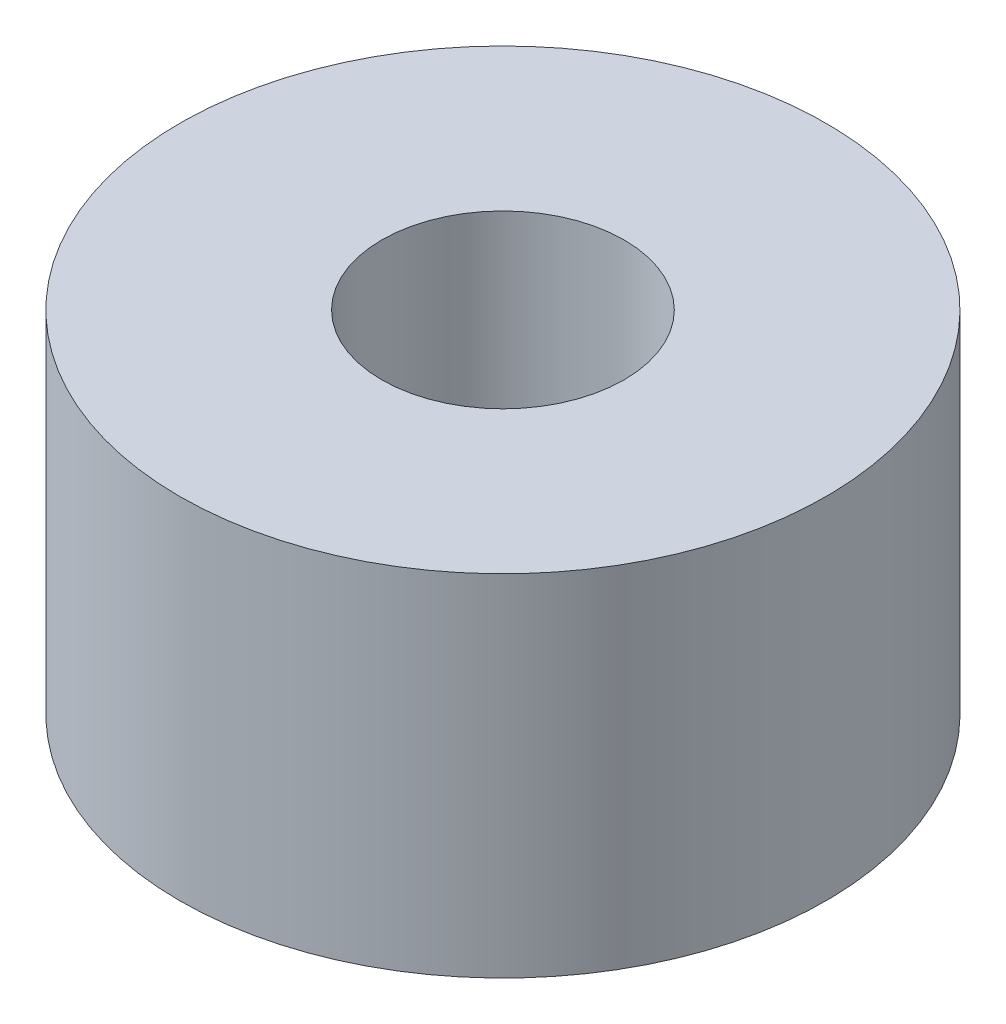
ISO-10303-21;
HEADER;
FILE_DESCRIPTION(('STEP AP214'),'2;1');
FILE_NAME('part.step','',(''),(''),'','','');
FILE_SCHEMA(('AUTOMOTIVE_DESIGN { 1 0 10303 214 1 1 1 1 }'));
ENDSEC;
DATA;
#1=APPLICATION_CONTEXT('core data for automotive mechanical design processes');
#2=APPLICATION_PROTOCOL_DEFINITION('international standard','automotive_design',2000,#1);
#3=PRODUCT_CONTEXT('',#1,'mechanical');
#4=PRODUCT('Part','Part','',(#3));
#5=PRODUCT_RELATED_PRODUCT_CATEGORY('part','',(#4));
#6=PRODUCT_DEFINITION_FORMATION('','',#4);
#7=PRODUCT_DEFINITION_CONTEXT('part definition',#1,'design');
#8=PRODUCT_DEFINITION('design','',#6,#7);
#9=PRODUCT_DEFINITION_SHAPE('','',#8);
#10=(LENGTH_UNIT() NAMED_UNIT(*) SI_UNIT(.MILLI.,.METRE.));
#11=(NAMED_UNIT(*) PLANE_ANGLE_UNIT() SI_UNIT($,.RADIAN.));
#12=(NAMED_UNIT(*) SI_UNIT($,.STERADIAN.) SOLID_ANGLE_UNIT());
#13=UNCERTAINTY_MEASURE_WITH_UNIT(LENGTH_MEASURE(1.E-05),#10,'distance_accuracy_value','');
#14=(GEOMETRIC_REPRESENTATION_CONTEXT(3) GLOBAL_UNCERTAINTY_ASSIGNED_CONTEXT((#13)) GLOBAL_UNIT_ASSIGNED_CONTEXT((#10,
#11,#12)) REPRESENTATION_CONTEXT('',''));
#15=CARTESIAN_POINT('',(0.,0.,0.));
#16=DIRECTION('',(0.,0.,1.));
#17=DIRECTION('',(1.,0.,0.));
#18=AXIS2_PLACEMENT_3D('',#15,#16,#17);
#19=CARTESIAN_POINT('',(0.,13.758801286,0.));
#20=DIRECTION('',(0.,-1.,0.));
#21=DIRECTION('',(0.,0.,-1.));
#22=AXIS2_PLACEMENT_3D('',#19,#20,#21);
#23=CYLINDRICAL_SURFACE('',#22,4.7625);
#24=CARTESIAN_POINT('',(0.,13.758801286,0.));
#25=DIRECTION('',(0.,1.,0.));
#26=DIRECTION('',(0.,0.,1.));
#27=AXIS2_PLACEMENT_3D('',#24,#25,#26);
#28=CIRCLE('',#27,4.7625);
#29=CARTESIAN_POINT('',(0.,13.758801286,4.7625));
#30=VERTEX_POINT('',#29);
#31=EDGE_CURVE('E37',#30,#30,#28,.T.);
#32=ORIENTED_EDGE('',*,*,#31,.T.);
#33=EDGE_LOOP('',(#32));
#34=FACE_BOUND('',#33,.T.);
#35=CARTESIAN_POINT('',(0.,0.,0.));
#36=DIRECTION('',(0.,1.,0.));
#37=DIRECTION('',(0.,0.,1.));
#38=AXIS2_PLACEMENT_3D('',#35,#36,#37);
#39=CIRCLE('',#38,4.7625);
#40=CARTESIAN_POINT('',(0.,0.,4.7625));
#41=VERTEX_POINT('',#40);
#42=EDGE_CURVE('E43',#41,#41,#39,.T.);
#43=ORIENTED_EDGE('',*,*,#42,.F.);
#44=EDGE_LOOP('',(#43));
#45=FACE_BOUND('',#44,.T.);
#46=ADVANCED_FACE('F30',(#34,#45),#23,.F.);
#47=CARTESIAN_POINT('',(0.,13.758801286,0.));
#48=DIRECTION('',(0.,-1.,0.));
#49=DIRECTION('',(0.,0.,-1.));
#50=AXIS2_PLACEMENT_3D('',#47,#48,#49);
#51=CYLINDRICAL_SURFACE('',#50,12.7);
#52=CARTESIAN_POINT('',(0.,13.758801286,0.));
#53=DIRECTION('',(0.,1.,0.));
#54=DIRECTION('',(0.,0.,1.));
#55=AXIS2_PLACEMENT_3D('',#52,#53,#54);
#56=CIRCLE('',#55,12.7);
#57=CARTESIAN_POINT('',(0.,13.758801286,12.7));
#58=VERTEX_POINT('',#57);
#59=EDGE_CURVE('E10',#58,#58,#56,.T.);
#60=ORIENTED_EDGE('',*,*,#59,.F.);
#61=EDGE_LOOP('',(#60));
#62=FACE_BOUND('',#61,.T.);
#63=CARTESIAN_POINT('',(0.,0.,0.));
#64=DIRECTION('',(0.,1.,0.));
#65=DIRECTION('',(0.,0.,1.));
#66=AXIS2_PLACEMENT_3D('',#63,#64,#65);
#67=CIRCLE('',#66,12.7);
#68=CARTESIAN_POINT('',(0.,0.,12.7));
#69=VERTEX_POINT('',#68);
#70=EDGE_CURVE('E33',#69,#69,#67,.T.);
#71=ORIENTED_EDGE('',*,*,#70,.T.);
#72=EDGE_LOOP('',(#71));
#73=FACE_BOUND('',#72,.T.);
#74=ADVANCED_FACE('F50',(#62,#73),#51,.T.);
#75=CARTESIAN_POINT('',(0.,13.758801286,0.));
#76=DIRECTION('',(0.,1.,0.));
#77=DIRECTION('',(0.,0.,1.));
#78=AXIS2_PLACEMENT_3D('',#75,#76,#77);
#79=PLANE('',#78);
#80=ORIENTED_EDGE('',*,*,#31,.F.);
#81=EDGE_LOOP('',(#80));
#82=FACE_BOUND('',#81,.T.);
#83=ORIENTED_EDGE('',*,*,#59,.T.);
#84=EDGE_LOOP('',(#83));
#85=FACE_BOUND('',#84,.T.);
#86=ADVANCED_FACE('F54',(#82,#85),#79,.T.);
#87=CARTESIAN_POINT('',(0.,0.,0.));
#88=DIRECTION('',(0.,1.,0.));
#89=DIRECTION('',(0.,0.,1.));
#90=AXIS2_PLACEMENT_3D('',#87,#88,#89);
#91=PLANE('',#90);
#92=ORIENTED_EDGE('',*,*,#42,.T.);
#93=EDGE_LOOP('',(#92));
#94=FACE_BOUND('',#93,.T.);
#95=ORIENTED_EDGE('',*,*,#70,.F.);
#96=EDGE_LOOP('',(#95));
#97=FACE_BOUND('',#96,.T.);
#98=ADVANCED_FACE('F52',(#94,#97),#91,.F.);
#99=CLOSED_SHELL('',(#46,#74,#86,#98));
#100=MANIFOLD_SOLID_BREP('B2',#99);
#101=ADVANCED_BREP_SHAPE_REPRESENTATION('',(#18,#100),#14);
#102=SHAPE_DEFINITION_REPRESENTATION(#9,#101);
ENDSEC;
END-ISO-10303-21;
